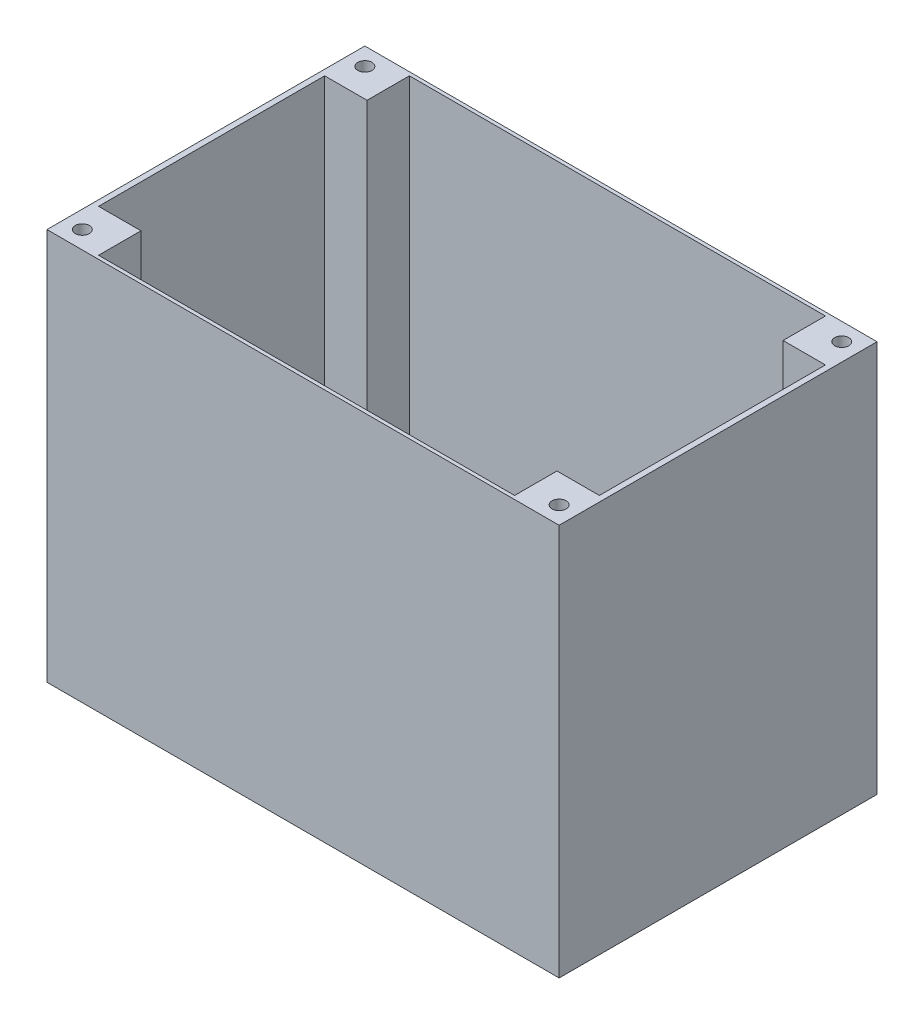
ISO-10303-21;
HEADER;
FILE_DESCRIPTION(('STEP AP214'),'2;1');
FILE_NAME('part.step','',(''),(''),'','','');
FILE_SCHEMA(('AUTOMOTIVE_DESIGN { 1 0 10303 214 1 1 1 1 }'));
ENDSEC;
DATA;
#1=APPLICATION_CONTEXT('core data for automotive mechanical design processes');
#2=APPLICATION_PROTOCOL_DEFINITION('international standard','automotive_design',2000,#1);
#3=PRODUCT_CONTEXT('',#1,'mechanical');
#4=PRODUCT('Part','Part','',(#3));
#5=PRODUCT_RELATED_PRODUCT_CATEGORY('part','',(#4));
#6=PRODUCT_DEFINITION_FORMATION('','',#4);
#7=PRODUCT_DEFINITION_CONTEXT('part definition',#1,'design');
#8=PRODUCT_DEFINITION('design','',#6,#7);
#9=PRODUCT_DEFINITION_SHAPE('','',#8);
#10=(LENGTH_UNIT() NAMED_UNIT(*) SI_UNIT(.MILLI.,.METRE.));
#11=(NAMED_UNIT(*) PLANE_ANGLE_UNIT() SI_UNIT($,.RADIAN.));
#12=(NAMED_UNIT(*) SI_UNIT($,.STERADIAN.) SOLID_ANGLE_UNIT());
#13=UNCERTAINTY_MEASURE_WITH_UNIT(LENGTH_MEASURE(1.E-05),#10,'distance_accuracy_value','');
#14=(GEOMETRIC_REPRESENTATION_CONTEXT(3) GLOBAL_UNCERTAINTY_ASSIGNED_CONTEXT((#13)) GLOBAL_UNIT_ASSIGNED_CONTEXT((#10,
#11,#12)) REPRESENTATION_CONTEXT('',''));
#15=CARTESIAN_POINT('',(0.,0.,0.));
#16=DIRECTION('',(0.,0.,1.));
#17=DIRECTION('',(1.,0.,0.));
#18=AXIS2_PLACEMENT_3D('',#15,#16,#17);
#19=CARTESIAN_POINT('',(0.,0.,0.));
#20=DIRECTION('',(0.,-1.,0.));
#21=DIRECTION('',(0.,0.,-1.));
#22=AXIS2_PLACEMENT_3D('',#19,#20,#21);
#23=PLANE('',#22);
#24=CARTESIAN_POINT('',(0.,0.,0.));
#25=DIRECTION('',(0.,1.,0.));
#26=DIRECTION('',(0.,0.,1.));
#27=AXIS2_PLACEMENT_3D('',#24,#25,#26);
#28=CIRCLE('',#27,10.);
#29=CARTESIAN_POINT('',(0.,0.,10.));
#30=VERTEX_POINT('',#29);
#31=EDGE_CURVE('E431',#30,#30,#28,.T.);
#32=ORIENTED_EDGE('',*,*,#31,.F.);
#33=EDGE_LOOP('',(#32));
#34=FACE_BOUND('',#33,.T.);
#35=DIRECTION('',(0.,0.,-1.));
#36=VECTOR('',#35,1.);
#37=CARTESIAN_POINT('',(-58.8888888888889,0.,44.));
#38=LINE('',#37,#36);
#39=CARTESIAN_POINT('',(-58.8888888888889,0.,44.));
#40=VERTEX_POINT('',#39);
#41=CARTESIAN_POINT('',(-58.8888888888889,0.,32.));
#42=VERTEX_POINT('',#41);
#43=EDGE_CURVE('E67',#40,#42,#38,.T.);
#44=ORIENTED_EDGE('',*,*,#43,.F.);
#45=DIRECTION('',(1.,0.,0.));
#46=VECTOR('',#45,1.);
#47=CARTESIAN_POINT('',(70.8888888888889,0.,44.));
#48=LINE('',#47,#46);
#49=CARTESIAN_POINT('',(58.8888888888889,0.,44.));
#50=VERTEX_POINT('',#49);
#51=EDGE_CURVE('E179',#40,#50,#48,.T.);
#52=ORIENTED_EDGE('',*,*,#51,.T.);
#53=DIRECTION('',(0.,0.,1.));
#54=VECTOR('',#53,1.);
#55=CARTESIAN_POINT('',(58.8888888888889,0.,44.));
#56=LINE('',#55,#54);
#57=CARTESIAN_POINT('',(58.8888888888889,0.,32.));
#58=VERTEX_POINT('',#57);
#59=EDGE_CURVE('E205',#58,#50,#56,.T.);
#60=ORIENTED_EDGE('',*,*,#59,.F.);
#61=DIRECTION('',(-1.,0.,0.));
#62=VECTOR('',#61,1.);
#63=CARTESIAN_POINT('',(70.8888888888889,0.,32.));
#64=LINE('',#63,#62);
#65=CARTESIAN_POINT('',(70.8888888888889,0.,32.));
#66=VERTEX_POINT('',#65);
#67=EDGE_CURVE('E211',#66,#58,#64,.T.);
#68=ORIENTED_EDGE('',*,*,#67,.F.);
#69=DIRECTION('',(0.,0.,-1.));
#70=VECTOR('',#69,1.);
#71=CARTESIAN_POINT('',(70.8888888888889,0.,44.));
#72=LINE('',#71,#70);
#73=CARTESIAN_POINT('',(70.8888888888889,0.,-32.));
#74=VERTEX_POINT('',#73);
#75=EDGE_CURVE('E312',#66,#74,#72,.T.);
#76=ORIENTED_EDGE('',*,*,#75,.T.);
#77=DIRECTION('',(1.,0.,0.));
#78=VECTOR('',#77,1.);
#79=CARTESIAN_POINT('',(70.8888888888889,0.,-32.));
#80=LINE('',#79,#78);
#81=CARTESIAN_POINT('',(58.8888888888889,0.,-32.));
#82=VERTEX_POINT('',#81);
#83=EDGE_CURVE('E238',#82,#74,#80,.T.);
#84=ORIENTED_EDGE('',*,*,#83,.F.);
#85=DIRECTION('',(0.,0.,1.));
#86=VECTOR('',#85,1.);
#87=CARTESIAN_POINT('',(58.8888888888889,0.,-44.));
#88=LINE('',#87,#86);
#89=CARTESIAN_POINT('',(58.8888888888889,0.,-44.));
#90=VERTEX_POINT('',#89);
#91=EDGE_CURVE('E237',#90,#82,#88,.T.);
#92=ORIENTED_EDGE('',*,*,#91,.F.);
#93=DIRECTION('',(-1.,0.,0.));
#94=VECTOR('',#93,1.);
#95=CARTESIAN_POINT('',(70.8888888888889,0.,-44.));
#96=LINE('',#95,#94);
#97=CARTESIAN_POINT('',(-58.8888888888889,0.,-44.));
#98=VERTEX_POINT('',#97);
#99=EDGE_CURVE('E300',#90,#98,#96,.T.);
#100=ORIENTED_EDGE('',*,*,#99,.T.);
#101=DIRECTION('',(0.,0.,-1.));
#102=VECTOR('',#101,1.);
#103=CARTESIAN_POINT('',(-58.8888888888889,0.,-44.));
#104=LINE('',#103,#102);
#105=CARTESIAN_POINT('',(-58.8888888888889,0.,-32.));
#106=VERTEX_POINT('',#105);
#107=EDGE_CURVE('E255',#106,#98,#104,.T.);
#108=ORIENTED_EDGE('',*,*,#107,.F.);
#109=DIRECTION('',(1.,0.,0.));
#110=VECTOR('',#109,1.);
#111=CARTESIAN_POINT('',(-70.8888888888889,0.,-32.));
#112=LINE('',#111,#110);
#113=CARTESIAN_POINT('',(-70.8888888888889,0.,-32.));
#114=VERTEX_POINT('',#113);
#115=EDGE_CURVE('E261',#114,#106,#112,.T.);
#116=ORIENTED_EDGE('',*,*,#115,.F.);
#117=DIRECTION('',(0.,0.,1.));
#118=VECTOR('',#117,1.);
#119=CARTESIAN_POINT('',(-70.8888888888889,0.,44.));
#120=LINE('',#119,#118);
#121=CARTESIAN_POINT('',(-70.8888888888889,0.,32.));
#122=VERTEX_POINT('',#121);
#123=EDGE_CURVE('E298',#114,#122,#120,.T.);
#124=ORIENTED_EDGE('',*,*,#123,.T.);
#125=DIRECTION('',(-1.,0.,0.));
#126=VECTOR('',#125,1.);
#127=CARTESIAN_POINT('',(-70.8888888888889,0.,32.));
#128=LINE('',#127,#126);
#129=EDGE_CURVE('E62',#42,#122,#128,.T.);
#130=ORIENTED_EDGE('',*,*,#129,.F.);
#131=EDGE_LOOP('',(#44,#52,#60,#68,#76,#84,#92,#100,#108,#116,#124,#130));
#132=FACE_BOUND('',#131,.T.);
#133=ADVANCED_FACE('F45',(#34,#132),#23,.F.);
#134=CARTESIAN_POINT('',(70.8888888888889,110.,44.));
#135=DIRECTION('',(0.,0.,-1.));
#136=DIRECTION('',(-1.,0.,0.));
#137=AXIS2_PLACEMENT_3D('',#134,#135,#136);
#138=PLANE('',#137);
#139=ORIENTED_EDGE('',*,*,#51,.F.);
#140=DIRECTION('',(0.,-1.,0.));
#141=VECTOR('',#140,1.);
#142=CARTESIAN_POINT('',(-58.8888888888889,126.970562748477,44.));
#143=LINE('',#142,#141);
#144=CARTESIAN_POINT('',(-58.8888888888889,110.,44.));
#145=VERTEX_POINT('',#144);
#146=EDGE_CURVE('E177',#145,#40,#143,.T.);
#147=ORIENTED_EDGE('',*,*,#146,.F.);
#148=DIRECTION('',(1.,0.,0.));
#149=VECTOR('',#148,1.);
#150=CARTESIAN_POINT('',(70.8888888888889,110.,44.));
#151=LINE('',#150,#149);
#152=CARTESIAN_POINT('',(58.8888888888889,110.,44.));
#153=VERTEX_POINT('',#152);
#154=EDGE_CURVE('E159',#145,#153,#151,.T.);
#155=ORIENTED_EDGE('',*,*,#154,.T.);
#156=DIRECTION('',(0.,-1.,0.));
#157=VECTOR('',#156,1.);
#158=CARTESIAN_POINT('',(58.8888888888889,126.970562748477,44.));
#159=LINE('',#158,#157);
#160=EDGE_CURVE('E202',#153,#50,#159,.T.);
#161=ORIENTED_EDGE('',*,*,#160,.T.);
#162=EDGE_LOOP('',(#139,#147,#155,#161));
#163=FACE_BOUND('',#162,.T.);
#164=ADVANCED_FACE('F178',(#163),#138,.T.);
#165=CARTESIAN_POINT('',(-70.8888888888889,110.,44.));
#166=DIRECTION('',(1.,0.,0.));
#167=DIRECTION('',(0.,0.,-1.));
#168=AXIS2_PLACEMENT_3D('',#165,#166,#167);
#169=PLANE('',#168);
#170=DIRECTION('',(0.,0.,1.));
#171=VECTOR('',#170,1.);
#172=CARTESIAN_POINT('',(-70.8888888888889,110.,44.));
#173=LINE('',#172,#171);
#174=CARTESIAN_POINT('',(-70.8888888888889,110.,-32.));
#175=VERTEX_POINT('',#174);
#176=CARTESIAN_POINT('',(-70.8888888888889,110.,32.));
#177=VERTEX_POINT('',#176);
#178=EDGE_CURVE('E174',#175,#177,#173,.T.);
#179=ORIENTED_EDGE('',*,*,#178,.T.);
#180=DIRECTION('',(0.,-1.,0.));
#181=VECTOR('',#180,1.);
#182=CARTESIAN_POINT('',(-70.8888888888889,126.970562748477,32.));
#183=LINE('',#182,#181);
#184=EDGE_CURVE('E182',#177,#122,#183,.T.);
#185=ORIENTED_EDGE('',*,*,#184,.T.);
#186=ORIENTED_EDGE('',*,*,#123,.F.);
#187=DIRECTION('',(0.,-1.,0.));
#188=VECTOR('',#187,1.);
#189=CARTESIAN_POINT('',(-70.8888888888889,126.970562748477,-32.));
#190=LINE('',#189,#188);
#191=EDGE_CURVE('E231',#175,#114,#190,.T.);
#192=ORIENTED_EDGE('',*,*,#191,.F.);
#193=EDGE_LOOP('',(#179,#185,#186,#192));
#194=FACE_BOUND('',#193,.T.);
#195=ADVANCED_FACE('F381',(#194),#169,.T.);
#196=CARTESIAN_POINT('',(70.8888888888889,110.,44.));
#197=DIRECTION('',(-1.,0.,0.));
#198=DIRECTION('',(0.,0.,1.));
#199=AXIS2_PLACEMENT_3D('',#196,#197,#198);
#200=PLANE('',#199);
#201=ORIENTED_EDGE('',*,*,#75,.F.);
#202=DIRECTION('',(0.,-1.,0.));
#203=VECTOR('',#202,1.);
#204=CARTESIAN_POINT('',(70.8888888888889,126.970562748477,32.));
#205=LINE('',#204,#203);
#206=CARTESIAN_POINT('',(70.8888888888889,110.,32.));
#207=VERTEX_POINT('',#206);
#208=EDGE_CURVE('E212',#207,#66,#205,.T.);
#209=ORIENTED_EDGE('',*,*,#208,.F.);
#210=DIRECTION('',(0.,0.,-1.));
#211=VECTOR('',#210,1.);
#212=CARTESIAN_POINT('',(70.8888888888889,110.,44.));
#213=LINE('',#212,#211);
#214=CARTESIAN_POINT('',(70.8888888888889,110.,-32.));
#215=VERTEX_POINT('',#214);
#216=EDGE_CURVE('E173',#207,#215,#213,.T.);
#217=ORIENTED_EDGE('',*,*,#216,.T.);
#218=DIRECTION('',(0.,-1.,0.));
#219=VECTOR('',#218,1.);
#220=CARTESIAN_POINT('',(70.8888888888889,126.970562748477,-32.));
#221=LINE('',#220,#219);
#222=EDGE_CURVE('E227',#215,#74,#221,.T.);
#223=ORIENTED_EDGE('',*,*,#222,.T.);
#224=EDGE_LOOP('',(#201,#209,#217,#223));
#225=FACE_BOUND('',#224,.T.);
#226=ADVANCED_FACE('F366',(#225),#200,.T.);
#227=CARTESIAN_POINT('',(70.8888888888889,110.,-44.));
#228=DIRECTION('',(0.,0.,1.));
#229=DIRECTION('',(1.,0.,0.));
#230=AXIS2_PLACEMENT_3D('',#227,#228,#229);
#231=PLANE('',#230);
#232=ORIENTED_EDGE('',*,*,#99,.F.);
#233=DIRECTION('',(0.,-1.,0.));
#234=VECTOR('',#233,1.);
#235=CARTESIAN_POINT('',(58.8888888888889,126.970562748477,-44.));
#236=LINE('',#235,#234);
#237=CARTESIAN_POINT('',(58.8888888888889,110.,-44.));
#238=VERTEX_POINT('',#237);
#239=EDGE_CURVE('E232',#238,#90,#236,.T.);
#240=ORIENTED_EDGE('',*,*,#239,.F.);
#241=DIRECTION('',(-1.,0.,0.));
#242=VECTOR('',#241,1.);
#243=CARTESIAN_POINT('',(70.8888888888889,110.,-44.));
#244=LINE('',#243,#242);
#245=CARTESIAN_POINT('',(-58.8888888888889,110.,-44.));
#246=VERTEX_POINT('',#245);
#247=EDGE_CURVE('E304',#238,#246,#244,.T.);
#248=ORIENTED_EDGE('',*,*,#247,.T.);
#249=DIRECTION('',(0.,-1.,0.));
#250=VECTOR('',#249,1.);
#251=CARTESIAN_POINT('',(-58.8888888888889,126.970562748477,-44.));
#252=LINE('',#251,#250);
#253=EDGE_CURVE('E259',#246,#98,#252,.T.);
#254=ORIENTED_EDGE('',*,*,#253,.T.);
#255=EDGE_LOOP('',(#232,#240,#248,#254));
#256=FACE_BOUND('',#255,.T.);
#257=ADVANCED_FACE('F357',(#256),#231,.T.);
#258=CARTESIAN_POINT('',(0.,110.,0.));
#259=DIRECTION('',(0.,1.,0.));
#260=DIRECTION('',(0.,0.,1.));
#261=AXIS2_PLACEMENT_3D('',#258,#259,#260);
#262=PLANE('',#261);
#263=CARTESIAN_POINT('',(67.5,110.,-40.));
#264=DIRECTION('',(0.,1.,0.));
#265=DIRECTION('',(0.,0.,-1.));
#266=AXIS2_PLACEMENT_3D('',#263,#264,#265);
#267=CIRCLE('',#266,2.);
#268=CARTESIAN_POINT('',(67.5,110.,-42.));
#269=VERTEX_POINT('',#268);
#270=EDGE_CURVE('E412',#269,#269,#267,.T.);
#271=ORIENTED_EDGE('',*,*,#270,.F.);
#272=EDGE_LOOP('',(#271));
#273=FACE_BOUND('',#272,.T.);
#274=CARTESIAN_POINT('',(67.5,110.,40.));
#275=DIRECTION('',(0.,1.,0.));
#276=DIRECTION('',(0.,0.,1.));
#277=AXIS2_PLACEMENT_3D('',#274,#275,#276);
#278=CIRCLE('',#277,2.);
#279=CARTESIAN_POINT('',(67.5,110.,42.));
#280=VERTEX_POINT('',#279);
#281=EDGE_CURVE('E420',#280,#280,#278,.T.);
#282=ORIENTED_EDGE('',*,*,#281,.F.);
#283=EDGE_LOOP('',(#282));
#284=FACE_BOUND('',#283,.T.);
#285=CARTESIAN_POINT('',(-67.5,110.,40.));
#286=DIRECTION('',(0.,1.,0.));
#287=DIRECTION('',(0.,0.,-1.));
#288=AXIS2_PLACEMENT_3D('',#285,#286,#287);
#289=CIRCLE('',#288,2.);
#290=CARTESIAN_POINT('',(-67.5,110.,38.));
#291=VERTEX_POINT('',#290);
#292=EDGE_CURVE('E406',#291,#291,#289,.T.);
#293=ORIENTED_EDGE('',*,*,#292,.F.);
#294=EDGE_LOOP('',(#293));
#295=FACE_BOUND('',#294,.T.);
#296=CARTESIAN_POINT('',(-67.5,110.,-40.));
#297=DIRECTION('',(0.,1.,0.));
#298=DIRECTION('',(0.,0.,1.));
#299=AXIS2_PLACEMENT_3D('',#296,#297,#298);
#300=CIRCLE('',#299,2.);
#301=CARTESIAN_POINT('',(-67.5,110.,-38.));
#302=VERTEX_POINT('',#301);
#303=EDGE_CURVE('E195',#302,#302,#300,.T.);
#304=ORIENTED_EDGE('',*,*,#303,.F.);
#305=EDGE_LOOP('',(#304));
#306=FACE_BOUND('',#305,.T.);
#307=ORIENTED_EDGE('',*,*,#216,.F.);
#308=DIRECTION('',(-1.,0.,0.));
#309=VECTOR('',#308,1.);
#310=CARTESIAN_POINT('',(70.8888888888889,110.,32.));
#311=LINE('',#310,#309);
#312=CARTESIAN_POINT('',(58.8888888888889,110.,32.));
#313=VERTEX_POINT('',#312);
#314=EDGE_CURVE('E206',#207,#313,#311,.T.);
#315=ORIENTED_EDGE('',*,*,#314,.T.);
#316=DIRECTION('',(0.,0.,1.));
#317=VECTOR('',#316,1.);
#318=CARTESIAN_POINT('',(58.8888888888889,110.,44.));
#319=LINE('',#318,#317);
#320=EDGE_CURVE('E168',#313,#153,#319,.T.);
#321=ORIENTED_EDGE('',*,*,#320,.T.);
#322=ORIENTED_EDGE('',*,*,#154,.F.);
#323=DIRECTION('',(0.,0.,-1.));
#324=VECTOR('',#323,1.);
#325=CARTESIAN_POINT('',(-58.8888888888889,110.,44.));
#326=LINE('',#325,#324);
#327=CARTESIAN_POINT('',(-58.8888888888889,110.,32.));
#328=VERTEX_POINT('',#327);
#329=EDGE_CURVE('E166',#145,#328,#326,.T.);
#330=ORIENTED_EDGE('',*,*,#329,.T.);
#331=DIRECTION('',(-1.,0.,0.));
#332=VECTOR('',#331,1.);
#333=CARTESIAN_POINT('',(-70.8888888888889,110.,32.));
#334=LINE('',#333,#332);
#335=EDGE_CURVE('E188',#328,#177,#334,.T.);
#336=ORIENTED_EDGE('',*,*,#335,.T.);
#337=ORIENTED_EDGE('',*,*,#178,.F.);
#338=DIRECTION('',(1.,0.,0.));
#339=VECTOR('',#338,1.);
#340=CARTESIAN_POINT('',(-70.8888888888889,110.,-32.));
#341=LINE('',#340,#339);
#342=CARTESIAN_POINT('',(-58.8888888888889,110.,-32.));
#343=VERTEX_POINT('',#342);
#344=EDGE_CURVE('E270',#175,#343,#341,.T.);
#345=ORIENTED_EDGE('',*,*,#344,.T.);
#346=DIRECTION('',(0.,0.,-1.));
#347=VECTOR('',#346,1.);
#348=CARTESIAN_POINT('',(-58.8888888888889,110.,-44.));
#349=LINE('',#348,#347);
#350=EDGE_CURVE('E265',#343,#246,#349,.T.);
#351=ORIENTED_EDGE('',*,*,#350,.T.);
#352=ORIENTED_EDGE('',*,*,#247,.F.);
#353=DIRECTION('',(0.,0.,1.));
#354=VECTOR('',#353,1.);
#355=CARTESIAN_POINT('',(58.8888888888889,110.,-44.));
#356=LINE('',#355,#354);
#357=CARTESIAN_POINT('',(58.8888888888889,110.,-32.));
#358=VERTEX_POINT('',#357);
#359=EDGE_CURVE('E216',#238,#358,#356,.T.);
#360=ORIENTED_EDGE('',*,*,#359,.T.);
#361=DIRECTION('',(1.,0.,0.));
#362=VECTOR('',#361,1.);
#363=CARTESIAN_POINT('',(70.8888888888889,110.,-32.));
#364=LINE('',#363,#362);
#365=EDGE_CURVE('E242',#358,#215,#364,.T.);
#366=ORIENTED_EDGE('',*,*,#365,.T.);
#367=EDGE_LOOP('',(#307,#315,#321,#322,#330,#336,#337,#345,#351,#352,#360,#366));
#368=FACE_BOUND('',#367,.T.);
#369=DIRECTION('',(0.,0.,1.));
#370=VECTOR('',#369,1.);
#371=CARTESIAN_POINT('',(-72.5,110.,45.));
#372=LINE('',#371,#370);
#373=CARTESIAN_POINT('',(-72.5,110.,-45.));
#374=VERTEX_POINT('',#373);
#375=CARTESIAN_POINT('',(-72.5,110.,45.));
#376=VERTEX_POINT('',#375);
#377=EDGE_CURVE('E307',#374,#376,#372,.T.);
#378=ORIENTED_EDGE('',*,*,#377,.T.);
#379=DIRECTION('',(1.,0.,0.));
#380=VECTOR('',#379,1.);
#381=CARTESIAN_POINT('',(72.5,110.,45.));
#382=LINE('',#381,#380);
#383=CARTESIAN_POINT('',(72.5,110.,45.));
#384=VERTEX_POINT('',#383);
#385=EDGE_CURVE('E320',#376,#384,#382,.T.);
#386=ORIENTED_EDGE('',*,*,#385,.T.);
#387=DIRECTION('',(0.,0.,-1.));
#388=VECTOR('',#387,1.);
#389=CARTESIAN_POINT('',(72.5,110.,45.));
#390=LINE('',#389,#388);
#391=CARTESIAN_POINT('',(72.5,110.,-45.));
#392=VERTEX_POINT('',#391);
#393=EDGE_CURVE('E323',#384,#392,#390,.T.);
#394=ORIENTED_EDGE('',*,*,#393,.T.);
#395=DIRECTION('',(-1.,0.,0.));
#396=VECTOR('',#395,1.);
#397=CARTESIAN_POINT('',(72.5,110.,-45.));
#398=LINE('',#397,#396);
#399=EDGE_CURVE('E326',#392,#374,#398,.T.);
#400=ORIENTED_EDGE('',*,*,#399,.T.);
#401=EDGE_LOOP('',(#378,#386,#394,#400));
#402=FACE_BOUND('',#401,.T.);
#403=ADVANCED_FACE('F162',(#273,#284,#295,#306,#368,#402),#262,.T.);
#404=CARTESIAN_POINT('',(-72.5,110.,45.));
#405=DIRECTION('',(1.,0.,0.));
#406=DIRECTION('',(0.,0.,-1.));
#407=AXIS2_PLACEMENT_3D('',#404,#405,#406);
#408=PLANE('',#407);
#409=DIRECTION('',(0.,-1.,0.));
#410=VECTOR('',#409,1.);
#411=CARTESIAN_POINT('',(-72.5,110.,-45.));
#412=LINE('',#411,#410);
#413=CARTESIAN_POINT('',(-72.5,-1.,-45.));
#414=VERTEX_POINT('',#413);
#415=EDGE_CURVE('E329',#374,#414,#412,.T.);
#416=ORIENTED_EDGE('',*,*,#415,.T.);
#417=DIRECTION('',(0.,0.,-1.));
#418=VECTOR('',#417,1.);
#419=CARTESIAN_POINT('',(-72.5,-1.,45.));
#420=LINE('',#419,#418);
#421=CARTESIAN_POINT('',(-72.5,-1.,45.));
#422=VERTEX_POINT('',#421);
#423=EDGE_CURVE('E286',#422,#414,#420,.T.);
#424=ORIENTED_EDGE('',*,*,#423,.F.);
#425=DIRECTION('',(0.,-1.,0.));
#426=VECTOR('',#425,1.);
#427=CARTESIAN_POINT('',(-72.5,110.,45.));
#428=LINE('',#427,#426);
#429=EDGE_CURVE('E11',#376,#422,#428,.T.);
#430=ORIENTED_EDGE('',*,*,#429,.F.);
#431=ORIENTED_EDGE('',*,*,#377,.F.);
#432=EDGE_LOOP('',(#416,#424,#430,#431));
#433=FACE_BOUND('',#432,.T.);
#434=ADVANCED_FACE('F47',(#433),#408,.F.);
#435=CARTESIAN_POINT('',(72.5,110.,45.));
#436=DIRECTION('',(0.,0.,-1.));
#437=DIRECTION('',(-1.,0.,0.));
#438=AXIS2_PLACEMENT_3D('',#435,#436,#437);
#439=PLANE('',#438);
#440=ORIENTED_EDGE('',*,*,#429,.T.);
#441=DIRECTION('',(-1.,0.,0.));
#442=VECTOR('',#441,1.);
#443=CARTESIAN_POINT('',(72.5,-1.,45.));
#444=LINE('',#443,#442);
#445=CARTESIAN_POINT('',(72.5,-1.,45.));
#446=VERTEX_POINT('',#445);
#447=EDGE_CURVE('E269',#446,#422,#444,.T.);
#448=ORIENTED_EDGE('',*,*,#447,.F.);
#449=DIRECTION('',(0.,-1.,0.));
#450=VECTOR('',#449,1.);
#451=CARTESIAN_POINT('',(72.5,110.,45.));
#452=LINE('',#451,#450);
#453=EDGE_CURVE('E55',#384,#446,#452,.T.);
#454=ORIENTED_EDGE('',*,*,#453,.F.);
#455=ORIENTED_EDGE('',*,*,#385,.F.);
#456=EDGE_LOOP('',(#440,#448,#454,#455));
#457=FACE_BOUND('',#456,.T.);
#458=ADVANCED_FACE('F347',(#457),#439,.F.);
#459=CARTESIAN_POINT('',(72.5,110.,45.));
#460=DIRECTION('',(-1.,0.,0.));
#461=DIRECTION('',(0.,0.,1.));
#462=AXIS2_PLACEMENT_3D('',#459,#460,#461);
#463=PLANE('',#462);
#464=ORIENTED_EDGE('',*,*,#453,.T.);
#465=DIRECTION('',(0.,0.,1.));
#466=VECTOR('',#465,1.);
#467=CARTESIAN_POINT('',(72.5,-1.,-45.));
#468=LINE('',#467,#466);
#469=CARTESIAN_POINT('',(72.5,-1.,-45.));
#470=VERTEX_POINT('',#469);
#471=EDGE_CURVE('E294',#470,#446,#468,.T.);
#472=ORIENTED_EDGE('',*,*,#471,.F.);
#473=DIRECTION('',(0.,-1.,0.));
#474=VECTOR('',#473,1.);
#475=CARTESIAN_POINT('',(72.5,110.,-45.));
#476=LINE('',#475,#474);
#477=EDGE_CURVE('E332',#392,#470,#476,.T.);
#478=ORIENTED_EDGE('',*,*,#477,.F.);
#479=ORIENTED_EDGE('',*,*,#393,.F.);
#480=EDGE_LOOP('',(#464,#472,#478,#479));
#481=FACE_BOUND('',#480,.T.);
#482=ADVANCED_FACE('F340',(#481),#463,.F.);
#483=CARTESIAN_POINT('',(72.5,110.,-45.));
#484=DIRECTION('',(0.,0.,1.));
#485=DIRECTION('',(1.,0.,0.));
#486=AXIS2_PLACEMENT_3D('',#483,#484,#485);
#487=PLANE('',#486);
#488=ORIENTED_EDGE('',*,*,#477,.T.);
#489=DIRECTION('',(1.,0.,0.));
#490=VECTOR('',#489,1.);
#491=CARTESIAN_POINT('',(-72.5,-1.,-45.));
#492=LINE('',#491,#490);
#493=EDGE_CURVE('E290',#414,#470,#492,.T.);
#494=ORIENTED_EDGE('',*,*,#493,.F.);
#495=ORIENTED_EDGE('',*,*,#415,.F.);
#496=ORIENTED_EDGE('',*,*,#399,.F.);
#497=EDGE_LOOP('',(#488,#494,#495,#496));
#498=FACE_BOUND('',#497,.T.);
#499=ADVANCED_FACE('F354',(#498),#487,.F.);
#500=CARTESIAN_POINT('',(0.,-1.,0.));
#501=DIRECTION('',(0.,-1.,0.));
#502=DIRECTION('',(0.,0.,-1.));
#503=AXIS2_PLACEMENT_3D('',#500,#501,#502);
#504=PLANE('',#503);
#505=CARTESIAN_POINT('',(0.,-1.,0.));
#506=DIRECTION('',(0.,-1.,0.));
#507=DIRECTION('',(0.,0.,-1.));
#508=AXIS2_PLACEMENT_3D('',#505,#506,#507);
#509=CIRCLE('',#508,10.);
#510=CARTESIAN_POINT('',(0.,-1.,-10.));
#511=VERTEX_POINT('',#510);
#512=EDGE_CURVE('E49',#511,#511,#509,.T.);
#513=ORIENTED_EDGE('',*,*,#512,.F.);
#514=EDGE_LOOP('',(#513));
#515=FACE_BOUND('',#514,.T.);
#516=ORIENTED_EDGE('',*,*,#447,.T.);
#517=ORIENTED_EDGE('',*,*,#423,.T.);
#518=ORIENTED_EDGE('',*,*,#493,.T.);
#519=ORIENTED_EDGE('',*,*,#471,.T.);
#520=EDGE_LOOP('',(#516,#517,#518,#519));
#521=FACE_BOUND('',#520,.T.);
#522=ADVANCED_FACE('F345',(#515,#521),#504,.T.);
#523=CARTESIAN_POINT('',(-70.8888888888889,126.970562748477,-32.));
#524=DIRECTION('',(0.,0.,-1.));
#525=DIRECTION('',(-1.,0.,0.));
#526=AXIS2_PLACEMENT_3D('',#523,#524,#525);
#527=PLANE('',#526);
#528=ORIENTED_EDGE('',*,*,#344,.F.);
#529=ORIENTED_EDGE('',*,*,#191,.T.);
#530=ORIENTED_EDGE('',*,*,#115,.T.);
#531=DIRECTION('',(0.,-1.,0.));
#532=VECTOR('',#531,1.);
#533=CARTESIAN_POINT('',(-58.8888888888889,126.970562748477,-32.));
#534=LINE('',#533,#532);
#535=EDGE_CURVE('E260',#343,#106,#534,.T.);
#536=ORIENTED_EDGE('',*,*,#535,.F.);
#537=EDGE_LOOP('',(#528,#529,#530,#536));
#538=FACE_BOUND('',#537,.T.);
#539=ADVANCED_FACE('F441',(#538),#527,.F.);
#540=CARTESIAN_POINT('',(-58.8888888888889,126.970562748477,-44.));
#541=DIRECTION('',(-1.,0.,0.));
#542=DIRECTION('',(0.,0.,1.));
#543=AXIS2_PLACEMENT_3D('',#540,#541,#542);
#544=PLANE('',#543);
#545=ORIENTED_EDGE('',*,*,#350,.F.);
#546=ORIENTED_EDGE('',*,*,#535,.T.);
#547=ORIENTED_EDGE('',*,*,#107,.T.);
#548=ORIENTED_EDGE('',*,*,#253,.F.);
#549=EDGE_LOOP('',(#545,#546,#547,#548));
#550=FACE_BOUND('',#549,.T.);
#551=ADVANCED_FACE('F446',(#550),#544,.F.);
#552=CARTESIAN_POINT('',(58.8888888888889,126.970562748477,-44.));
#553=DIRECTION('',(1.,0.,0.));
#554=DIRECTION('',(0.,0.,-1.));
#555=AXIS2_PLACEMENT_3D('',#552,#553,#554);
#556=PLANE('',#555);
#557=ORIENTED_EDGE('',*,*,#359,.F.);
#558=ORIENTED_EDGE('',*,*,#239,.T.);
#559=ORIENTED_EDGE('',*,*,#91,.T.);
#560=DIRECTION('',(0.,-1.,0.));
#561=VECTOR('',#560,1.);
#562=CARTESIAN_POINT('',(58.8888888888889,126.970562748477,-32.));
#563=LINE('',#562,#561);
#564=EDGE_CURVE('E233',#358,#82,#563,.T.);
#565=ORIENTED_EDGE('',*,*,#564,.F.);
#566=EDGE_LOOP('',(#557,#558,#559,#565));
#567=FACE_BOUND('',#566,.T.);
#568=ADVANCED_FACE('F533',(#567),#556,.F.);
#569=CARTESIAN_POINT('',(70.8888888888889,126.970562748477,-32.));
#570=DIRECTION('',(0.,0.,-1.));
#571=DIRECTION('',(-1.,0.,0.));
#572=AXIS2_PLACEMENT_3D('',#569,#570,#571);
#573=PLANE('',#572);
#574=ORIENTED_EDGE('',*,*,#365,.F.);
#575=ORIENTED_EDGE('',*,*,#564,.T.);
#576=ORIENTED_EDGE('',*,*,#83,.T.);
#577=ORIENTED_EDGE('',*,*,#222,.F.);
#578=EDGE_LOOP('',(#574,#575,#576,#577));
#579=FACE_BOUND('',#578,.T.);
#580=ADVANCED_FACE('F543',(#579),#573,.F.);
#581=CARTESIAN_POINT('',(70.8888888888889,126.970562748477,32.));
#582=DIRECTION('',(0.,0.,1.));
#583=DIRECTION('',(1.,0.,0.));
#584=AXIS2_PLACEMENT_3D('',#581,#582,#583);
#585=PLANE('',#584);
#586=ORIENTED_EDGE('',*,*,#314,.F.);
#587=ORIENTED_EDGE('',*,*,#208,.T.);
#588=ORIENTED_EDGE('',*,*,#67,.T.);
#589=DIRECTION('',(0.,-1.,0.));
#590=VECTOR('',#589,1.);
#591=CARTESIAN_POINT('',(58.8888888888889,126.970562748477,32.));
#592=LINE('',#591,#590);
#593=EDGE_CURVE('E207',#313,#58,#592,.T.);
#594=ORIENTED_EDGE('',*,*,#593,.F.);
#595=EDGE_LOOP('',(#586,#587,#588,#594));
#596=FACE_BOUND('',#595,.T.);
#597=ADVANCED_FACE('F553',(#596),#585,.F.);
#598=CARTESIAN_POINT('',(58.8888888888889,126.970562748477,44.));
#599=DIRECTION('',(1.,0.,0.));
#600=DIRECTION('',(0.,0.,-1.));
#601=AXIS2_PLACEMENT_3D('',#598,#599,#600);
#602=PLANE('',#601);
#603=ORIENTED_EDGE('',*,*,#320,.F.);
#604=ORIENTED_EDGE('',*,*,#593,.T.);
#605=ORIENTED_EDGE('',*,*,#59,.T.);
#606=ORIENTED_EDGE('',*,*,#160,.F.);
#607=EDGE_LOOP('',(#603,#604,#605,#606));
#608=FACE_BOUND('',#607,.T.);
#609=ADVANCED_FACE('F563',(#608),#602,.F.);
#610=CARTESIAN_POINT('',(-58.8888888888889,126.970562748477,44.));
#611=DIRECTION('',(-1.,0.,0.));
#612=DIRECTION('',(0.,0.,1.));
#613=AXIS2_PLACEMENT_3D('',#610,#611,#612);
#614=PLANE('',#613);
#615=ORIENTED_EDGE('',*,*,#329,.F.);
#616=ORIENTED_EDGE('',*,*,#146,.T.);
#617=ORIENTED_EDGE('',*,*,#43,.T.);
#618=DIRECTION('',(0.,-1.,0.));
#619=VECTOR('',#618,1.);
#620=CARTESIAN_POINT('',(-58.8888888888889,126.970562748477,32.));
#621=LINE('',#620,#619);
#622=EDGE_CURVE('E185',#328,#42,#621,.T.);
#623=ORIENTED_EDGE('',*,*,#622,.F.);
#624=EDGE_LOOP('',(#615,#616,#617,#623));
#625=FACE_BOUND('',#624,.T.);
#626=ADVANCED_FACE('F184',(#625),#614,.F.);
#627=CARTESIAN_POINT('',(-70.8888888888889,126.970562748477,32.));
#628=DIRECTION('',(0.,0.,1.));
#629=DIRECTION('',(1.,0.,0.));
#630=AXIS2_PLACEMENT_3D('',#627,#628,#629);
#631=PLANE('',#630);
#632=ORIENTED_EDGE('',*,*,#335,.F.);
#633=ORIENTED_EDGE('',*,*,#622,.T.);
#634=ORIENTED_EDGE('',*,*,#129,.T.);
#635=ORIENTED_EDGE('',*,*,#184,.F.);
#636=EDGE_LOOP('',(#632,#633,#634,#635));
#637=FACE_BOUND('',#636,.T.);
#638=ADVANCED_FACE('F398',(#637),#631,.F.);
#639=CARTESIAN_POINT('',(-67.5,98.,-40.));
#640=DIRECTION('',(0.,1.,0.));
#641=DIRECTION('',(0.,0.,1.));
#642=AXIS2_PLACEMENT_3D('',#639,#640,#641);
#643=CYLINDRICAL_SURFACE('',#642,2.);
#644=CARTESIAN_POINT('',(-67.5,98.,-40.));
#645=DIRECTION('',(0.,1.,0.));
#646=DIRECTION('',(0.,0.,1.));
#647=AXIS2_PLACEMENT_3D('',#644,#645,#646);
#648=CIRCLE('',#647,2.);
#649=CARTESIAN_POINT('',(-67.5,98.,-38.));
#650=VERTEX_POINT('',#649);
#651=EDGE_CURVE('E189',#650,#650,#648,.T.);
#652=ORIENTED_EDGE('',*,*,#651,.F.);
#653=EDGE_LOOP('',(#652));
#654=FACE_BOUND('',#653,.T.);
#655=ORIENTED_EDGE('',*,*,#303,.T.);
#656=EDGE_LOOP('',(#655));
#657=FACE_BOUND('',#656,.T.);
#658=ADVANCED_FACE('F589',(#654,#657),#643,.F.);
#659=CARTESIAN_POINT('',(-67.5,98.,-40.));
#660=DIRECTION('',(0.,1.,0.));
#661=DIRECTION('',(0.,0.,1.));
#662=AXIS2_PLACEMENT_3D('',#659,#660,#661);
#663=PLANE('',#662);
#664=ORIENTED_EDGE('',*,*,#651,.T.);
#665=EDGE_LOOP('',(#664));
#666=FACE_BOUND('',#665,.T.);
#667=ADVANCED_FACE('F597',(#666),#663,.T.);
#668=CARTESIAN_POINT('',(-67.5,98.,40.));
#669=DIRECTION('',(0.,1.,0.));
#670=DIRECTION('',(0.,0.,1.));
#671=AXIS2_PLACEMENT_3D('',#668,#669,#670);
#672=CYLINDRICAL_SURFACE('',#671,2.);
#673=CARTESIAN_POINT('',(-67.5,98.,40.));
#674=DIRECTION('',(0.,1.,0.));
#675=DIRECTION('',(0.,0.,-1.));
#676=AXIS2_PLACEMENT_3D('',#673,#674,#675);
#677=CIRCLE('',#676,2.);
#678=CARTESIAN_POINT('',(-67.5,98.,38.));
#679=VERTEX_POINT('',#678);
#680=EDGE_CURVE('E424',#679,#679,#677,.T.);
#681=ORIENTED_EDGE('',*,*,#680,.F.);
#682=EDGE_LOOP('',(#681));
#683=FACE_BOUND('',#682,.T.);
#684=ORIENTED_EDGE('',*,*,#292,.T.);
#685=EDGE_LOOP('',(#684));
#686=FACE_BOUND('',#685,.T.);
#687=ADVANCED_FACE('F607',(#683,#686),#672,.F.);
#688=CARTESIAN_POINT('',(-67.5,98.,40.));
#689=DIRECTION('',(0.,-1.,0.));
#690=DIRECTION('',(0.,0.,-1.));
#691=AXIS2_PLACEMENT_3D('',#688,#689,#690);
#692=PLANE('',#691);
#693=ORIENTED_EDGE('',*,*,#680,.T.);
#694=EDGE_LOOP('',(#693));
#695=FACE_BOUND('',#694,.T.);
#696=ADVANCED_FACE('F617',(#695),#692,.F.);
#697=CARTESIAN_POINT('',(67.5,98.,40.));
#698=DIRECTION('',(0.,1.,0.));
#699=DIRECTION('',(0.,0.,1.));
#700=AXIS2_PLACEMENT_3D('',#697,#698,#699);
#701=CYLINDRICAL_SURFACE('',#700,2.);
#702=CARTESIAN_POINT('',(67.5,98.,40.));
#703=DIRECTION('',(0.,1.,0.));
#704=DIRECTION('',(0.,0.,1.));
#705=AXIS2_PLACEMENT_3D('',#702,#703,#704);
#706=CIRCLE('',#705,2.);
#707=CARTESIAN_POINT('',(67.5,98.,42.));
#708=VERTEX_POINT('',#707);
#709=EDGE_CURVE('E416',#708,#708,#706,.T.);
#710=ORIENTED_EDGE('',*,*,#709,.F.);
#711=EDGE_LOOP('',(#710));
#712=FACE_BOUND('',#711,.T.);
#713=ORIENTED_EDGE('',*,*,#281,.T.);
#714=EDGE_LOOP('',(#713));
#715=FACE_BOUND('',#714,.T.);
#716=ADVANCED_FACE('F627',(#712,#715),#701,.F.);
#717=CARTESIAN_POINT('',(67.5,98.,40.));
#718=DIRECTION('',(0.,1.,0.));
#719=DIRECTION('',(0.,0.,1.));
#720=AXIS2_PLACEMENT_3D('',#717,#718,#719);
#721=PLANE('',#720);
#722=ORIENTED_EDGE('',*,*,#709,.T.);
#723=EDGE_LOOP('',(#722));
#724=FACE_BOUND('',#723,.T.);
#725=ADVANCED_FACE('F637',(#724),#721,.T.);
#726=CARTESIAN_POINT('',(67.5,98.,-40.));
#727=DIRECTION('',(0.,1.,0.));
#728=DIRECTION('',(0.,0.,1.));
#729=AXIS2_PLACEMENT_3D('',#726,#727,#728);
#730=CYLINDRICAL_SURFACE('',#729,2.);
#731=CARTESIAN_POINT('',(67.5,98.,-40.));
#732=DIRECTION('',(0.,1.,0.));
#733=DIRECTION('',(0.,0.,-1.));
#734=AXIS2_PLACEMENT_3D('',#731,#732,#733);
#735=CIRCLE('',#734,2.);
#736=CARTESIAN_POINT('',(67.5,98.,-42.));
#737=VERTEX_POINT('',#736);
#738=EDGE_CURVE('E408',#737,#737,#735,.T.);
#739=ORIENTED_EDGE('',*,*,#738,.F.);
#740=EDGE_LOOP('',(#739));
#741=FACE_BOUND('',#740,.T.);
#742=ORIENTED_EDGE('',*,*,#270,.T.);
#743=EDGE_LOOP('',(#742));
#744=FACE_BOUND('',#743,.T.);
#745=ADVANCED_FACE('F647',(#741,#744),#730,.F.);
#746=CARTESIAN_POINT('',(67.5,98.,-40.));
#747=DIRECTION('',(0.,-1.,0.));
#748=DIRECTION('',(0.,0.,-1.));
#749=AXIS2_PLACEMENT_3D('',#746,#747,#748);
#750=PLANE('',#749);
#751=ORIENTED_EDGE('',*,*,#738,.T.);
#752=EDGE_LOOP('',(#751));
#753=FACE_BOUND('',#752,.T.);
#754=ADVANCED_FACE('F657',(#753),#750,.F.);
#755=CARTESIAN_POINT('',(0.,-12.,0.));
#756=DIRECTION('',(0.,1.,0.));
#757=DIRECTION('',(0.,0.,1.));
#758=AXIS2_PLACEMENT_3D('',#755,#756,#757);
#759=CYLINDRICAL_SURFACE('',#758,10.);
#760=ORIENTED_EDGE('',*,*,#512,.T.);
#761=EDGE_LOOP('',(#760));
#762=FACE_BOUND('',#761,.T.);
#763=ORIENTED_EDGE('',*,*,#31,.T.);
#764=EDGE_LOOP('',(#763));
#765=FACE_BOUND('',#764,.T.);
#766=ADVANCED_FACE('F439',(#762,#765),#759,.F.);
#767=CLOSED_SHELL('',(#133,#164,#195,#226,#257,#403,#434,#458,#482,#499,#522,#539,#551,#568,
#580,#597,#609,#626,#638,#658,#667,#687,#696,#716,#725,#745,#754,#766));
#768=MANIFOLD_SOLID_BREP('B2',#767);
#769=ADVANCED_BREP_SHAPE_REPRESENTATION('',(#18,#768),#14);
#770=SHAPE_DEFINITION_REPRESENTATION(#9,#769);
ENDSEC;
END-ISO-10303-21;
